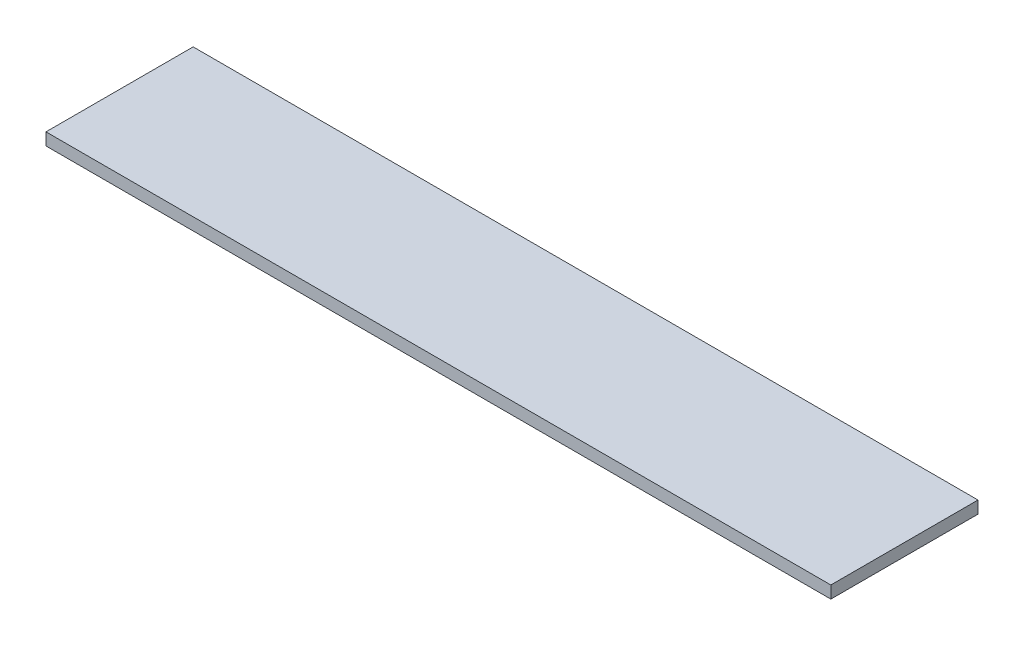
ISO-10303-21;
HEADER;
FILE_DESCRIPTION(('STEP AP214'),'2;1');
FILE_NAME('part.step','',(''),(''),'','','');
FILE_SCHEMA(('AUTOMOTIVE_DESIGN { 1 0 10303 214 1 1 1 1 }'));
ENDSEC;
DATA;
#1=APPLICATION_CONTEXT('core data for automotive mechanical design processes');
#2=APPLICATION_PROTOCOL_DEFINITION('international standard','automotive_design',2000,#1);
#3=PRODUCT_CONTEXT('',#1,'mechanical');
#4=PRODUCT('Part','Part','',(#3));
#5=PRODUCT_RELATED_PRODUCT_CATEGORY('part','',(#4));
#6=PRODUCT_DEFINITION_FORMATION('','',#4);
#7=PRODUCT_DEFINITION_CONTEXT('part definition',#1,'design');
#8=PRODUCT_DEFINITION('design','',#6,#7);
#9=PRODUCT_DEFINITION_SHAPE('','',#8);
#10=(LENGTH_UNIT() NAMED_UNIT(*) SI_UNIT(.MILLI.,.METRE.));
#11=(NAMED_UNIT(*) PLANE_ANGLE_UNIT() SI_UNIT($,.RADIAN.));
#12=(NAMED_UNIT(*) SI_UNIT($,.STERADIAN.) SOLID_ANGLE_UNIT());
#13=UNCERTAINTY_MEASURE_WITH_UNIT(LENGTH_MEASURE(1.E-05),#10,'distance_accuracy_value','');
#14=(GEOMETRIC_REPRESENTATION_CONTEXT(3) GLOBAL_UNCERTAINTY_ASSIGNED_CONTEXT((#13)) GLOBAL_UNIT_ASSIGNED_CONTEXT((#10,
#11,#12)) REPRESENTATION_CONTEXT('',''));
#15=CARTESIAN_POINT('',(0.,0.,0.));
#16=DIRECTION('',(0.,0.,1.));
#17=DIRECTION('',(1.,0.,0.));
#18=AXIS2_PLACEMENT_3D('',#15,#16,#17);
#19=CARTESIAN_POINT('',(0.,6.35,0.));
#20=DIRECTION('',(1.,0.,0.));
#21=DIRECTION('',(0.,0.,1.));
#22=AXIS2_PLACEMENT_3D('',#19,#20,#21);
#23=PLANE('',#22);
#24=DIRECTION('',(0.,0.,-1.));
#25=VECTOR('',#24,1.);
#26=CARTESIAN_POINT('',(0.,0.,0.));
#27=LINE('',#26,#25);
#28=CARTESIAN_POINT('',(0.,0.,76.2));
#29=VERTEX_POINT('',#28);
#30=CARTESIAN_POINT('',(0.,0.,0.));
#31=VERTEX_POINT('',#30);
#32=EDGE_CURVE('E115',#29,#31,#27,.T.);
#33=ORIENTED_EDGE('',*,*,#32,.F.);
#34=DIRECTION('',(0.,-1.,0.));
#35=VECTOR('',#34,1.);
#36=CARTESIAN_POINT('',(0.,6.35,76.2));
#37=LINE('',#36,#35);
#38=CARTESIAN_POINT('',(0.,6.35,76.2));
#39=VERTEX_POINT('',#38);
#40=EDGE_CURVE('E114',#39,#29,#37,.T.);
#41=ORIENTED_EDGE('',*,*,#40,.F.);
#42=DIRECTION('',(0.,0.,-1.));
#43=VECTOR('',#42,1.);
#44=CARTESIAN_POINT('',(0.,6.35,0.));
#45=LINE('',#44,#43);
#46=CARTESIAN_POINT('',(0.,6.35,0.));
#47=VERTEX_POINT('',#46);
#48=EDGE_CURVE('E106',#39,#47,#45,.T.);
#49=ORIENTED_EDGE('',*,*,#48,.T.);
#50=DIRECTION('',(0.,-1.,0.));
#51=VECTOR('',#50,1.);
#52=CARTESIAN_POINT('',(0.,6.35,0.));
#53=LINE('',#52,#51);
#54=EDGE_CURVE('E11',#47,#31,#53,.T.);
#55=ORIENTED_EDGE('',*,*,#54,.T.);
#56=EDGE_LOOP('',(#33,#41,#49,#55));
#57=FACE_BOUND('',#56,.T.);
#58=ADVANCED_FACE('F45',(#57),#23,.F.);
#59=CARTESIAN_POINT('',(0.,6.35,0.));
#60=DIRECTION('',(0.,0.,1.));
#61=DIRECTION('',(-1.,0.,0.));
#62=AXIS2_PLACEMENT_3D('',#59,#60,#61);
#63=PLANE('',#62);
#64=DIRECTION('',(1.,0.,0.));
#65=VECTOR('',#64,1.);
#66=CARTESIAN_POINT('',(0.,0.,0.));
#67=LINE('',#66,#65);
#68=CARTESIAN_POINT('',(406.4,0.,0.));
#69=VERTEX_POINT('',#68);
#70=EDGE_CURVE('E118',#31,#69,#67,.T.);
#71=ORIENTED_EDGE('',*,*,#70,.F.);
#72=ORIENTED_EDGE('',*,*,#54,.F.);
#73=DIRECTION('',(1.,0.,0.));
#74=VECTOR('',#73,1.);
#75=CARTESIAN_POINT('',(0.,6.35,0.));
#76=LINE('',#75,#74);
#77=CARTESIAN_POINT('',(406.4,6.35,0.));
#78=VERTEX_POINT('',#77);
#79=EDGE_CURVE('E87',#47,#78,#76,.T.);
#80=ORIENTED_EDGE('',*,*,#79,.T.);
#81=DIRECTION('',(0.,-1.,0.));
#82=VECTOR('',#81,1.);
#83=CARTESIAN_POINT('',(406.4,6.35,0.));
#84=LINE('',#83,#82);
#85=EDGE_CURVE('E54',#78,#69,#84,.T.);
#86=ORIENTED_EDGE('',*,*,#85,.T.);
#87=EDGE_LOOP('',(#71,#72,#80,#86));
#88=FACE_BOUND('',#87,.T.);
#89=ADVANCED_FACE('F103',(#88),#63,.F.);
#90=CARTESIAN_POINT('',(406.4,6.35,0.));
#91=DIRECTION('',(-1.,0.,0.));
#92=DIRECTION('',(0.,0.,-1.));
#93=AXIS2_PLACEMENT_3D('',#90,#91,#92);
#94=PLANE('',#93);
#95=DIRECTION('',(0.,0.,1.));
#96=VECTOR('',#95,1.);
#97=CARTESIAN_POINT('',(406.4,0.,0.));
#98=LINE('',#97,#96);
#99=CARTESIAN_POINT('',(406.4,0.,76.2));
#100=VERTEX_POINT('',#99);
#101=EDGE_CURVE('E98',#69,#100,#98,.T.);
#102=ORIENTED_EDGE('',*,*,#101,.F.);
#103=ORIENTED_EDGE('',*,*,#85,.F.);
#104=DIRECTION('',(0.,0.,1.));
#105=VECTOR('',#104,1.);
#106=CARTESIAN_POINT('',(406.4,6.35,0.));
#107=LINE('',#106,#105);
#108=CARTESIAN_POINT('',(406.4,6.35,76.2));
#109=VERTEX_POINT('',#108);
#110=EDGE_CURVE('E90',#78,#109,#107,.T.);
#111=ORIENTED_EDGE('',*,*,#110,.T.);
#112=DIRECTION('',(0.,-1.,0.));
#113=VECTOR('',#112,1.);
#114=CARTESIAN_POINT('',(406.4,6.35,76.2));
#115=LINE('',#114,#113);
#116=EDGE_CURVE('E102',#109,#100,#115,.T.);
#117=ORIENTED_EDGE('',*,*,#116,.T.);
#118=EDGE_LOOP('',(#102,#103,#111,#117));
#119=FACE_BOUND('',#118,.T.);
#120=ADVANCED_FACE('F97',(#119),#94,.F.);
#121=CARTESIAN_POINT('',(0.,6.35,76.2));
#122=DIRECTION('',(0.,0.,-1.));
#123=DIRECTION('',(1.,0.,0.));
#124=AXIS2_PLACEMENT_3D('',#121,#122,#123);
#125=PLANE('',#124);
#126=DIRECTION('',(-1.,0.,0.));
#127=VECTOR('',#126,1.);
#128=CARTESIAN_POINT('',(0.,0.,76.2));
#129=LINE('',#128,#127);
#130=EDGE_CURVE('E76',#100,#29,#129,.T.);
#131=ORIENTED_EDGE('',*,*,#130,.F.);
#132=ORIENTED_EDGE('',*,*,#116,.F.);
#133=DIRECTION('',(-1.,0.,0.));
#134=VECTOR('',#133,1.);
#135=CARTESIAN_POINT('',(0.,6.35,76.2));
#136=LINE('',#135,#134);
#137=EDGE_CURVE('E62',#109,#39,#136,.T.);
#138=ORIENTED_EDGE('',*,*,#137,.T.);
#139=ORIENTED_EDGE('',*,*,#40,.T.);
#140=EDGE_LOOP('',(#131,#132,#138,#139));
#141=FACE_BOUND('',#140,.T.);
#142=ADVANCED_FACE('F131',(#141),#125,.F.);
#143=CARTESIAN_POINT('',(0.,6.35,0.));
#144=DIRECTION('',(0.,-1.,0.));
#145=DIRECTION('',(0.,0.,1.));
#146=AXIS2_PLACEMENT_3D('',#143,#144,#145);
#147=PLANE('',#146);
#148=ORIENTED_EDGE('',*,*,#48,.F.);
#149=ORIENTED_EDGE('',*,*,#137,.F.);
#150=ORIENTED_EDGE('',*,*,#110,.F.);
#151=ORIENTED_EDGE('',*,*,#79,.F.);
#152=EDGE_LOOP('',(#148,#149,#150,#151));
#153=FACE_BOUND('',#152,.T.);
#154=ADVANCED_FACE('F92',(#153),#147,.F.);
#155=CARTESIAN_POINT('',(0.,0.,0.));
#156=DIRECTION('',(0.,-1.,0.));
#157=DIRECTION('',(0.,0.,1.));
#158=AXIS2_PLACEMENT_3D('',#155,#156,#157);
#159=PLANE('',#158);
#160=ORIENTED_EDGE('',*,*,#32,.T.);
#161=ORIENTED_EDGE('',*,*,#70,.T.);
#162=ORIENTED_EDGE('',*,*,#101,.T.);
#163=ORIENTED_EDGE('',*,*,#130,.T.);
#164=EDGE_LOOP('',(#160,#161,#162,#163));
#165=FACE_BOUND('',#164,.T.);
#166=ADVANCED_FACE('F127',(#165),#159,.T.);
#167=CLOSED_SHELL('',(#58,#89,#120,#142,#154,#166));
#168=MANIFOLD_SOLID_BREP('B2',#167);
#169=ADVANCED_BREP_SHAPE_REPRESENTATION('',(#18,#168),#14);
#170=SHAPE_DEFINITION_REPRESENTATION(#9,#169);
ENDSEC;
END-ISO-10303-21;
